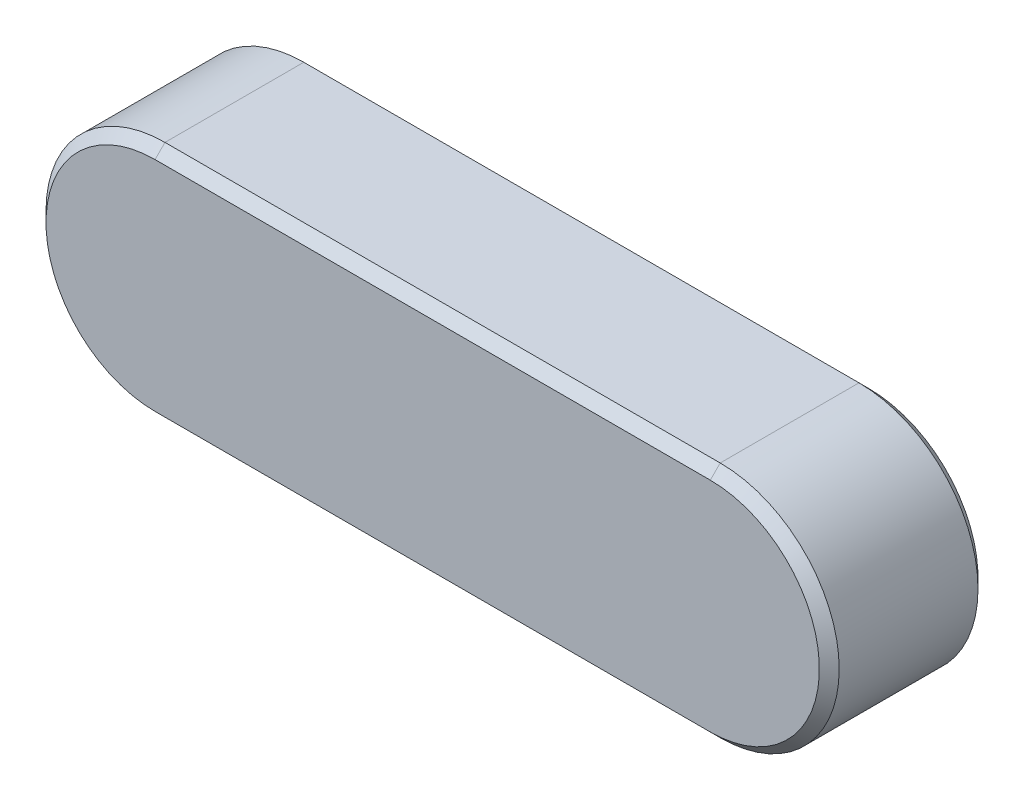
ISO-10303-21;
HEADER;
FILE_DESCRIPTION(('STEP AP214'),'2;1');
FILE_NAME('part.step','',(''),(''),'','','');
FILE_SCHEMA(('AUTOMOTIVE_DESIGN { 1 0 10303 214 1 1 1 1 }'));
ENDSEC;
DATA;
#1=APPLICATION_CONTEXT('core data for automotive mechanical design processes');
#2=APPLICATION_PROTOCOL_DEFINITION('international standard','automotive_design',2000,#1);
#3=PRODUCT_CONTEXT('',#1,'mechanical');
#4=PRODUCT('Part','Part','',(#3));
#5=PRODUCT_RELATED_PRODUCT_CATEGORY('part','',(#4));
#6=PRODUCT_DEFINITION_FORMATION('','',#4);
#7=PRODUCT_DEFINITION_CONTEXT('part definition',#1,'design');
#8=PRODUCT_DEFINITION('design','',#6,#7);
#9=PRODUCT_DEFINITION_SHAPE('','',#8);
#10=(LENGTH_UNIT() NAMED_UNIT(*) SI_UNIT(.MILLI.,.METRE.));
#11=(NAMED_UNIT(*) PLANE_ANGLE_UNIT() SI_UNIT($,.RADIAN.));
#12=(NAMED_UNIT(*) SI_UNIT($,.STERADIAN.) SOLID_ANGLE_UNIT());
#13=UNCERTAINTY_MEASURE_WITH_UNIT(LENGTH_MEASURE(1.E-05),#10,'distance_accuracy_value','');
#14=(GEOMETRIC_REPRESENTATION_CONTEXT(3) GLOBAL_UNCERTAINTY_ASSIGNED_CONTEXT((#13)) GLOBAL_UNIT_ASSIGNED_CONTEXT((#10,
#11,#12)) REPRESENTATION_CONTEXT('',''));
#15=CARTESIAN_POINT('',(0.,0.,0.));
#16=DIRECTION('',(0.,0.,1.));
#17=DIRECTION('',(1.,0.,0.));
#18=AXIS2_PLACEMENT_3D('',#15,#16,#17);
#19=CARTESIAN_POINT('',(0.,0.,4.));
#20=DIRECTION('',(0.,0.,-1.));
#21=DIRECTION('',(-1.,0.,0.));
#22=AXIS2_PLACEMENT_3D('',#19,#20,#21);
#23=CYLINDRICAL_SURFACE('',#22,3.);
#24=DIRECTION('',(0.,0.,-1.));
#25=VECTOR('',#24,1.);
#26=CARTESIAN_POINT('',(0.,-3.,4.));
#27=LINE('',#26,#25);
#28=CARTESIAN_POINT('',(0.,-3.,3.75));
#29=VERTEX_POINT('',#28);
#30=CARTESIAN_POINT('',(0.,-3.,0.25));
#31=VERTEX_POINT('',#30);
#32=EDGE_CURVE('E154',#29,#31,#27,.T.);
#33=ORIENTED_EDGE('',*,*,#32,.T.);
#34=CARTESIAN_POINT('',(0.,0.,0.25));
#35=DIRECTION('',(0.,0.,1.));
#36=DIRECTION('',(1.,0.,0.));
#37=AXIS2_PLACEMENT_3D('',#34,#35,#36);
#38=CIRCLE('',#37,3.);
#39=CARTESIAN_POINT('',(0.,3.,0.25));
#40=VERTEX_POINT('',#39);
#41=EDGE_CURVE('E178',#31,#40,#38,.T.);
#42=ORIENTED_EDGE('',*,*,#41,.T.);
#43=DIRECTION('',(0.,0.,-1.));
#44=VECTOR('',#43,1.);
#45=CARTESIAN_POINT('',(0.,3.,4.));
#46=LINE('',#45,#44);
#47=CARTESIAN_POINT('',(0.,3.,3.75));
#48=VERTEX_POINT('',#47);
#49=EDGE_CURVE('E123',#48,#40,#46,.T.);
#50=ORIENTED_EDGE('',*,*,#49,.F.);
#51=CARTESIAN_POINT('',(0.,0.,3.75));
#52=DIRECTION('',(0.,0.,1.));
#53=DIRECTION('',(1.,0.,0.));
#54=AXIS2_PLACEMENT_3D('',#51,#52,#53);
#55=CIRCLE('',#54,3.);
#56=EDGE_CURVE('E176',#48,#29,#55,.F.);
#57=ORIENTED_EDGE('',*,*,#56,.T.);
#58=EDGE_LOOP('',(#33,#42,#50,#57));
#59=FACE_BOUND('',#58,.T.);
#60=ADVANCED_FACE('F32',(#59),#23,.T.);
#61=CARTESIAN_POINT('',(0.,3.,4.));
#62=DIRECTION('',(0.,-1.,0.));
#63=DIRECTION('',(1.,0.,0.));
#64=AXIS2_PLACEMENT_3D('',#61,#62,#63);
#65=PLANE('',#64);
#66=ORIENTED_EDGE('',*,*,#49,.T.);
#67=DIRECTION('',(-1.,0.,0.));
#68=VECTOR('',#67,1.);
#69=CARTESIAN_POINT('',(0.,3.,0.250000000000002));
#70=LINE('',#69,#68);
#71=CARTESIAN_POINT('',(-14.,3.,0.25));
#72=VERTEX_POINT('',#71);
#73=EDGE_CURVE('E122',#40,#72,#70,.T.);
#74=ORIENTED_EDGE('',*,*,#73,.T.);
#75=DIRECTION('',(0.,0.,-1.));
#76=VECTOR('',#75,1.);
#77=CARTESIAN_POINT('',(-14.,3.,4.));
#78=LINE('',#77,#76);
#79=CARTESIAN_POINT('',(-14.,3.,3.75));
#80=VERTEX_POINT('',#79);
#81=EDGE_CURVE('E105',#80,#72,#78,.T.);
#82=ORIENTED_EDGE('',*,*,#81,.F.);
#83=DIRECTION('',(1.,0.,0.));
#84=VECTOR('',#83,1.);
#85=CARTESIAN_POINT('',(0.,3.,3.75));
#86=LINE('',#85,#84);
#87=EDGE_CURVE('E119',#80,#48,#86,.T.);
#88=ORIENTED_EDGE('',*,*,#87,.T.);
#89=EDGE_LOOP('',(#66,#74,#82,#88));
#90=FACE_BOUND('',#89,.T.);
#91=ADVANCED_FACE('F118',(#90),#65,.F.);
#92=CARTESIAN_POINT('',(-14.,0.,4.));
#93=DIRECTION('',(0.,0.,-1.));
#94=DIRECTION('',(-1.,0.,0.));
#95=AXIS2_PLACEMENT_3D('',#92,#93,#94);
#96=CYLINDRICAL_SURFACE('',#95,3.);
#97=ORIENTED_EDGE('',*,*,#81,.T.);
#98=CARTESIAN_POINT('',(-14.,0.,0.25));
#99=DIRECTION('',(0.,0.,1.));
#100=DIRECTION('',(1.,0.,0.));
#101=AXIS2_PLACEMENT_3D('',#98,#99,#100);
#102=CIRCLE('',#101,3.);
#103=CARTESIAN_POINT('',(-14.,-3.,0.25));
#104=VERTEX_POINT('',#103);
#105=EDGE_CURVE('E111',#72,#104,#102,.T.);
#106=ORIENTED_EDGE('',*,*,#105,.T.);
#107=DIRECTION('',(0.,0.,-1.));
#108=VECTOR('',#107,1.);
#109=CARTESIAN_POINT('',(-14.,-3.,4.));
#110=LINE('',#109,#108);
#111=CARTESIAN_POINT('',(-14.,-3.,3.75));
#112=VERTEX_POINT('',#111);
#113=EDGE_CURVE('E107',#112,#104,#110,.T.);
#114=ORIENTED_EDGE('',*,*,#113,.F.);
#115=CARTESIAN_POINT('',(-14.,0.,3.75));
#116=DIRECTION('',(0.,0.,1.));
#117=DIRECTION('',(1.,0.,0.));
#118=AXIS2_PLACEMENT_3D('',#115,#116,#117);
#119=CIRCLE('',#118,3.);
#120=EDGE_CURVE('E102',#112,#80,#119,.F.);
#121=ORIENTED_EDGE('',*,*,#120,.T.);
#122=EDGE_LOOP('',(#97,#106,#114,#121));
#123=FACE_BOUND('',#122,.T.);
#124=ADVANCED_FACE('F104',(#123),#96,.T.);
#125=CARTESIAN_POINT('',(-14.,-3.,4.));
#126=DIRECTION('',(0.,1.,0.));
#127=DIRECTION('',(0.,0.,1.));
#128=AXIS2_PLACEMENT_3D('',#125,#126,#127);
#129=PLANE('',#128);
#130=ORIENTED_EDGE('',*,*,#113,.T.);
#131=DIRECTION('',(1.,0.,0.));
#132=VECTOR('',#131,1.);
#133=CARTESIAN_POINT('',(-14.,-3.,0.25));
#134=LINE('',#133,#132);
#135=EDGE_CURVE('E182',#104,#31,#134,.T.);
#136=ORIENTED_EDGE('',*,*,#135,.T.);
#137=ORIENTED_EDGE('',*,*,#32,.F.);
#138=DIRECTION('',(-1.,0.,0.));
#139=VECTOR('',#138,1.);
#140=CARTESIAN_POINT('',(-14.,-3.,3.75));
#141=LINE('',#140,#139);
#142=EDGE_CURVE('E180',#29,#112,#141,.T.);
#143=ORIENTED_EDGE('',*,*,#142,.T.);
#144=EDGE_LOOP('',(#130,#136,#137,#143));
#145=FACE_BOUND('',#144,.T.);
#146=ADVANCED_FACE('F192',(#145),#129,.F.);
#147=CARTESIAN_POINT('',(0.,0.,4.));
#148=DIRECTION('',(0.,0.,1.));
#149=DIRECTION('',(1.,0.,0.));
#150=AXIS2_PLACEMENT_3D('',#147,#148,#149);
#151=PLANE('',#150);
#152=CARTESIAN_POINT('',(0.,0.,4.));
#153=DIRECTION('',(0.,0.,1.));
#154=DIRECTION('',(1.,0.,0.));
#155=AXIS2_PLACEMENT_3D('',#152,#153,#154);
#156=CIRCLE('',#155,2.75);
#157=CARTESIAN_POINT('',(0.,-2.75,4.));
#158=VERTEX_POINT('',#157);
#159=CARTESIAN_POINT('',(0.,2.75,4.));
#160=VERTEX_POINT('',#159);
#161=EDGE_CURVE('E56',#158,#160,#156,.T.);
#162=ORIENTED_EDGE('',*,*,#161,.T.);
#163=DIRECTION('',(-1.,0.,0.));
#164=VECTOR('',#163,1.);
#165=CARTESIAN_POINT('',(-14.,2.75,4.));
#166=LINE('',#165,#164);
#167=CARTESIAN_POINT('',(-14.,2.75,4.));
#168=VERTEX_POINT('',#167);
#169=EDGE_CURVE('E11',#160,#168,#166,.T.);
#170=ORIENTED_EDGE('',*,*,#169,.T.);
#171=CARTESIAN_POINT('',(-14.,0.,4.));
#172=DIRECTION('',(0.,0.,1.));
#173=DIRECTION('',(1.,0.,0.));
#174=AXIS2_PLACEMENT_3D('',#171,#172,#173);
#175=CIRCLE('',#174,2.75);
#176=CARTESIAN_POINT('',(-14.,-2.75,4.));
#177=VERTEX_POINT('',#176);
#178=EDGE_CURVE('E41',#168,#177,#175,.T.);
#179=ORIENTED_EDGE('',*,*,#178,.T.);
#180=DIRECTION('',(1.,0.,0.));
#181=VECTOR('',#180,1.);
#182=CARTESIAN_POINT('',(0.,-2.75,4.));
#183=LINE('',#182,#181);
#184=EDGE_CURVE('E184',#177,#158,#183,.T.);
#185=ORIENTED_EDGE('',*,*,#184,.T.);
#186=EDGE_LOOP('',(#162,#170,#179,#185));
#187=FACE_BOUND('',#186,.T.);
#188=ADVANCED_FACE('F187',(#187),#151,.T.);
#189=CARTESIAN_POINT('',(0.,0.,0.));
#190=DIRECTION('',(0.,0.,1.));
#191=DIRECTION('',(1.,0.,0.));
#192=AXIS2_PLACEMENT_3D('',#189,#190,#191);
#193=PLANE('',#192);
#194=CARTESIAN_POINT('',(-14.,0.,0.));
#195=DIRECTION('',(0.,0.,1.));
#196=DIRECTION('',(1.,0.,0.));
#197=AXIS2_PLACEMENT_3D('',#194,#195,#196);
#198=CIRCLE('',#197,2.75);
#199=CARTESIAN_POINT('',(-14.,-2.75,0.));
#200=VERTEX_POINT('',#199);
#201=CARTESIAN_POINT('',(-14.,2.75,0.));
#202=VERTEX_POINT('',#201);
#203=EDGE_CURVE('E171',#200,#202,#198,.F.);
#204=ORIENTED_EDGE('',*,*,#203,.T.);
#205=DIRECTION('',(1.,0.,0.));
#206=VECTOR('',#205,1.);
#207=CARTESIAN_POINT('',(0.,2.74999999999999,0.));
#208=LINE('',#207,#206);
#209=CARTESIAN_POINT('',(0.,2.75,0.));
#210=VERTEX_POINT('',#209);
#211=EDGE_CURVE('E112',#202,#210,#208,.T.);
#212=ORIENTED_EDGE('',*,*,#211,.T.);
#213=CARTESIAN_POINT('',(0.,0.,0.));
#214=DIRECTION('',(0.,0.,1.));
#215=DIRECTION('',(1.,0.,0.));
#216=AXIS2_PLACEMENT_3D('',#213,#214,#215);
#217=CIRCLE('',#216,2.75);
#218=CARTESIAN_POINT('',(0.,-2.75,0.));
#219=VERTEX_POINT('',#218);
#220=EDGE_CURVE('E169',#210,#219,#217,.F.);
#221=ORIENTED_EDGE('',*,*,#220,.T.);
#222=DIRECTION('',(-1.,0.,0.));
#223=VECTOR('',#222,1.);
#224=CARTESIAN_POINT('',(0.,-2.75,0.));
#225=LINE('',#224,#223);
#226=EDGE_CURVE('E167',#219,#200,#225,.T.);
#227=ORIENTED_EDGE('',*,*,#226,.T.);
#228=EDGE_LOOP('',(#204,#212,#221,#227));
#229=FACE_BOUND('',#228,.T.);
#230=ADVANCED_FACE('F219',(#229),#193,.F.);
#231=CARTESIAN_POINT('',(-14.,-3.,0.25));
#232=DIRECTION('',(0.,0.707106781186545,0.70710678118655));
#233=DIRECTION('',(0.,-0.70710678118655,0.707106781186545));
#234=AXIS2_PLACEMENT_3D('',#231,#232,#233);
#235=PLANE('',#234);
#236=DIRECTION('',(0.,-0.70710678118655,0.707106781186545));
#237=VECTOR('',#236,1.);
#238=CARTESIAN_POINT('',(-14.,-2.75,0.));
#239=LINE('',#238,#237);
#240=EDGE_CURVE('E146',#200,#104,#239,.T.);
#241=ORIENTED_EDGE('',*,*,#240,.F.);
#242=ORIENTED_EDGE('',*,*,#226,.F.);
#243=DIRECTION('',(0.,0.70710678118655,-0.707106781186545));
#244=VECTOR('',#243,1.);
#245=CARTESIAN_POINT('',(0.,-3.,0.25));
#246=LINE('',#245,#244);
#247=EDGE_CURVE('E134',#31,#219,#246,.T.);
#248=ORIENTED_EDGE('',*,*,#247,.F.);
#249=ORIENTED_EDGE('',*,*,#135,.F.);
#250=EDGE_LOOP('',(#241,#242,#248,#249));
#251=FACE_BOUND('',#250,.T.);
#252=ADVANCED_FACE('F195',(#251),#235,.F.);
#253=CARTESIAN_POINT('',(0.,0.,0.25));
#254=DIRECTION('',(0.,0.,1.));
#255=DIRECTION('',(1.,0.,0.));
#256=AXIS2_PLACEMENT_3D('',#253,#254,#255);
#257=CONICAL_SURFACE('',#256,3.,0.785398163397452);
#258=ORIENTED_EDGE('',*,*,#247,.T.);
#259=ORIENTED_EDGE('',*,*,#220,.F.);
#260=DIRECTION('',(0.,-0.70710678118655,-0.707106781186545));
#261=VECTOR('',#260,1.);
#262=CARTESIAN_POINT('',(0.,3.,0.25));
#263=LINE('',#262,#261);
#264=EDGE_CURVE('E140',#40,#210,#263,.T.);
#265=ORIENTED_EDGE('',*,*,#264,.F.);
#266=ORIENTED_EDGE('',*,*,#41,.F.);
#267=EDGE_LOOP('',(#258,#259,#265,#266));
#268=FACE_BOUND('',#267,.T.);
#269=ADVANCED_FACE('F198',(#268),#257,.T.);
#270=CARTESIAN_POINT('',(-14.,0.,0.25));
#271=DIRECTION('',(0.,0.,1.));
#272=DIRECTION('',(1.,0.,0.));
#273=AXIS2_PLACEMENT_3D('',#270,#271,#272);
#274=CONICAL_SURFACE('',#273,3.,0.785398163397452);
#275=ORIENTED_EDGE('',*,*,#240,.T.);
#276=ORIENTED_EDGE('',*,*,#105,.F.);
#277=DIRECTION('',(0.,0.70710678118655,0.707106781186545));
#278=VECTOR('',#277,1.);
#279=CARTESIAN_POINT('',(-14.,2.75,0.));
#280=LINE('',#279,#278);
#281=EDGE_CURVE('E137',#202,#72,#280,.T.);
#282=ORIENTED_EDGE('',*,*,#281,.F.);
#283=ORIENTED_EDGE('',*,*,#203,.F.);
#284=EDGE_LOOP('',(#275,#276,#282,#283));
#285=FACE_BOUND('',#284,.T.);
#286=ADVANCED_FACE('F201',(#285),#274,.T.);
#287=CARTESIAN_POINT('',(0.,3.,0.250000000000002));
#288=DIRECTION('',(0.,-0.707106781186543,0.707106781186552));
#289=DIRECTION('',(0.,-0.707106781186552,-0.707106781186543));
#290=AXIS2_PLACEMENT_3D('',#287,#288,#289);
#291=PLANE('',#290);
#292=ORIENTED_EDGE('',*,*,#264,.T.);
#293=ORIENTED_EDGE('',*,*,#211,.F.);
#294=ORIENTED_EDGE('',*,*,#281,.T.);
#295=ORIENTED_EDGE('',*,*,#73,.F.);
#296=EDGE_LOOP('',(#292,#293,#294,#295));
#297=FACE_BOUND('',#296,.T.);
#298=ADVANCED_FACE('F199',(#297),#291,.F.);
#299=CARTESIAN_POINT('',(0.,-2.75,4.));
#300=DIRECTION('',(0.,-0.70710678118655,0.707106781186545));
#301=DIRECTION('',(0.,-0.707106781186545,-0.70710678118655));
#302=AXIS2_PLACEMENT_3D('',#299,#300,#301);
#303=PLANE('',#302);
#304=DIRECTION('',(0.,0.707106781186545,0.70710678118655));
#305=VECTOR('',#304,1.);
#306=CARTESIAN_POINT('',(-14.,-3.,3.75));
#307=LINE('',#306,#305);
#308=EDGE_CURVE('E131',#112,#177,#307,.T.);
#309=ORIENTED_EDGE('',*,*,#308,.F.);
#310=ORIENTED_EDGE('',*,*,#142,.F.);
#311=DIRECTION('',(0.,-0.707106781186545,-0.70710678118655));
#312=VECTOR('',#311,1.);
#313=CARTESIAN_POINT('',(0.,-2.75,4.));
#314=LINE('',#313,#312);
#315=EDGE_CURVE('E36',#158,#29,#314,.T.);
#316=ORIENTED_EDGE('',*,*,#315,.F.);
#317=ORIENTED_EDGE('',*,*,#184,.F.);
#318=EDGE_LOOP('',(#309,#310,#316,#317));
#319=FACE_BOUND('',#318,.T.);
#320=ADVANCED_FACE('F34',(#319),#303,.T.);
#321=CARTESIAN_POINT('',(0.,0.,4.));
#322=DIRECTION('',(0.,0.,-1.));
#323=DIRECTION('',(-1.,0.,0.));
#324=AXIS2_PLACEMENT_3D('',#321,#322,#323);
#325=CONICAL_SURFACE('',#324,2.75,0.785398163397445);
#326=ORIENTED_EDGE('',*,*,#315,.T.);
#327=ORIENTED_EDGE('',*,*,#56,.F.);
#328=DIRECTION('',(0.,0.707106781186545,-0.70710678118655));
#329=VECTOR('',#328,1.);
#330=CARTESIAN_POINT('',(0.,2.75,4.));
#331=LINE('',#330,#329);
#332=EDGE_CURVE('E126',#160,#48,#331,.T.);
#333=ORIENTED_EDGE('',*,*,#332,.F.);
#334=ORIENTED_EDGE('',*,*,#161,.F.);
#335=EDGE_LOOP('',(#326,#327,#333,#334));
#336=FACE_BOUND('',#335,.T.);
#337=ADVANCED_FACE('F190',(#336),#325,.T.);
#338=CARTESIAN_POINT('',(-14.,0.,4.));
#339=DIRECTION('',(0.,0.,-1.));
#340=DIRECTION('',(-1.,0.,0.));
#341=AXIS2_PLACEMENT_3D('',#338,#339,#340);
#342=CONICAL_SURFACE('',#341,2.75,0.785398163397445);
#343=ORIENTED_EDGE('',*,*,#308,.T.);
#344=ORIENTED_EDGE('',*,*,#178,.F.);
#345=DIRECTION('',(0.,-0.707106781186545,0.70710678118655));
#346=VECTOR('',#345,1.);
#347=CARTESIAN_POINT('',(-14.,3.,3.75));
#348=LINE('',#347,#346);
#349=EDGE_CURVE('E49',#80,#168,#348,.T.);
#350=ORIENTED_EDGE('',*,*,#349,.F.);
#351=ORIENTED_EDGE('',*,*,#120,.F.);
#352=EDGE_LOOP('',(#343,#344,#350,#351));
#353=FACE_BOUND('',#352,.T.);
#354=ADVANCED_FACE('F129',(#353),#342,.T.);
#355=CARTESIAN_POINT('',(0.,2.75,4.));
#356=DIRECTION('',(0.,0.70710678118655,0.707106781186545));
#357=DIRECTION('',(0.,-0.707106781186545,0.70710678118655));
#358=AXIS2_PLACEMENT_3D('',#355,#356,#357);
#359=PLANE('',#358);
#360=ORIENTED_EDGE('',*,*,#332,.T.);
#361=ORIENTED_EDGE('',*,*,#87,.F.);
#362=ORIENTED_EDGE('',*,*,#349,.T.);
#363=ORIENTED_EDGE('',*,*,#169,.F.);
#364=EDGE_LOOP('',(#360,#361,#362,#363));
#365=FACE_BOUND('',#364,.T.);
#366=ADVANCED_FACE('F125',(#365),#359,.T.);
#367=CLOSED_SHELL('',(#60,#91,#124,#146,#188,#230,#252,#269,#286,#298,#320,#337,#354,#366));
#368=MANIFOLD_SOLID_BREP('B2',#367);
#369=ADVANCED_BREP_SHAPE_REPRESENTATION('',(#18,#368),#14);
#370=SHAPE_DEFINITION_REPRESENTATION(#9,#369);
ENDSEC;
END-ISO-10303-21;
